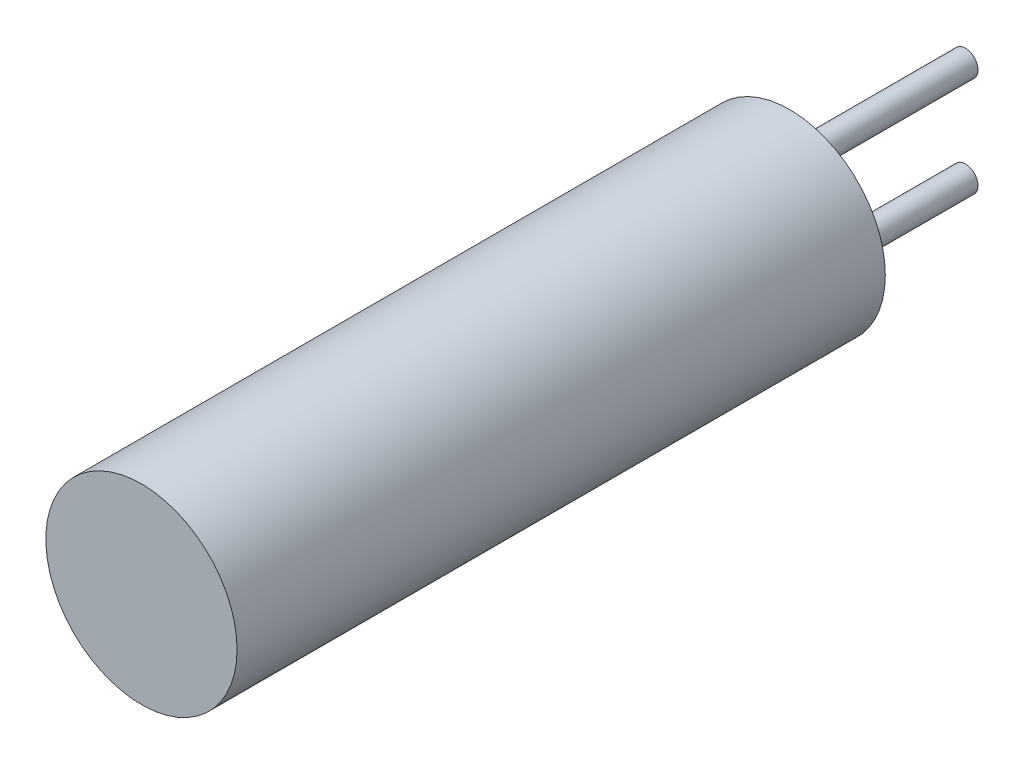
ISO-10303-21;
HEADER;
FILE_DESCRIPTION(('STEP AP214'),'2;1');
FILE_NAME('part.step','',(''),(''),'','','');
FILE_SCHEMA(('AUTOMOTIVE_DESIGN { 1 0 10303 214 1 1 1 1 }'));
ENDSEC;
DATA;
#1=APPLICATION_CONTEXT('core data for automotive mechanical design processes');
#2=APPLICATION_PROTOCOL_DEFINITION('international standard','automotive_design',2000,#1);
#3=PRODUCT_CONTEXT('',#1,'mechanical');
#4=PRODUCT('Part','Part','',(#3));
#5=PRODUCT_RELATED_PRODUCT_CATEGORY('part','',(#4));
#6=PRODUCT_DEFINITION_FORMATION('','',#4);
#7=PRODUCT_DEFINITION_CONTEXT('part definition',#1,'design');
#8=PRODUCT_DEFINITION('design','',#6,#7);
#9=PRODUCT_DEFINITION_SHAPE('','',#8);
#10=(LENGTH_UNIT() NAMED_UNIT(*) SI_UNIT(.MILLI.,.METRE.));
#11=(NAMED_UNIT(*) PLANE_ANGLE_UNIT() SI_UNIT($,.RADIAN.));
#12=(NAMED_UNIT(*) SI_UNIT($,.STERADIAN.) SOLID_ANGLE_UNIT());
#13=UNCERTAINTY_MEASURE_WITH_UNIT(LENGTH_MEASURE(1.E-05),#10,'distance_accuracy_value','');
#14=(GEOMETRIC_REPRESENTATION_CONTEXT(3) GLOBAL_UNCERTAINTY_ASSIGNED_CONTEXT((#13)) GLOBAL_UNIT_ASSIGNED_CONTEXT((#10,
#11,#12)) REPRESENTATION_CONTEXT('',''));
#15=CARTESIAN_POINT('',(0.,0.,0.));
#16=DIRECTION('',(0.,0.,1.));
#17=DIRECTION('',(1.,0.,0.));
#18=AXIS2_PLACEMENT_3D('',#15,#16,#17);
#19=CARTESIAN_POINT('',(0.,0.,-5.42));
#20=DIRECTION('',(0.,0.,-1.));
#21=DIRECTION('',(-1.,0.,0.));
#22=AXIS2_PLACEMENT_3D('',#19,#20,#21);
#23=PLANE('',#22);
#24=CARTESIAN_POINT('',(0.,1.489822979376,-5.42));
#25=DIRECTION('',(0.,0.,-1.));
#26=DIRECTION('',(-1.,0.,0.));
#27=AXIS2_PLACEMENT_3D('',#24,#25,#26);
#28=CIRCLE('',#27,0.3898185985847);
#29=CARTESIAN_POINT('',(-0.3898185985847,1.489822979376,-5.42));
#30=VERTEX_POINT('',#29);
#31=EDGE_CURVE('E18',#30,#30,#28,.F.);
#32=ORIENTED_EDGE('',*,*,#31,.F.);
#33=EDGE_LOOP('',(#32));
#34=FACE_BOUND('',#33,.T.);
#35=ADVANCED_FACE('F15',(#34),#23,.T.);
#36=CARTESIAN_POINT('',(0.,0.,-5.42));
#37=DIRECTION('',(0.,0.,-1.));
#38=DIRECTION('',(-1.,0.,0.));
#39=AXIS2_PLACEMENT_3D('',#36,#37,#38);
#40=PLANE('',#39);
#41=CARTESIAN_POINT('',(0.,-1.602262449517,-5.42));
#42=DIRECTION('',(0.,0.,-1.));
#43=DIRECTION('',(-1.,0.,0.));
#44=AXIS2_PLACEMENT_3D('',#41,#42,#43);
#45=CIRCLE('',#44,0.3898185985847);
#46=CARTESIAN_POINT('',(-0.3898185985847,-1.602262449517,-5.42));
#47=VERTEX_POINT('',#46);
#48=EDGE_CURVE('E34',#47,#47,#45,.F.);
#49=ORIENTED_EDGE('',*,*,#48,.F.);
#50=EDGE_LOOP('',(#49));
#51=FACE_BOUND('',#50,.T.);
#52=ADVANCED_FACE('F45',(#51),#40,.T.);
#53=CARTESIAN_POINT('',(0.,1.489822979376,0.));
#54=DIRECTION('',(0.,0.,-1.));
#55=DIRECTION('',(-1.,0.,0.));
#56=AXIS2_PLACEMENT_3D('',#53,#54,#55);
#57=CYLINDRICAL_SURFACE('',#56,0.3898185985847);
#58=ORIENTED_EDGE('',*,*,#31,.T.);
#59=EDGE_LOOP('',(#58));
#60=FACE_BOUND('',#59,.T.);
#61=CARTESIAN_POINT('',(0.,1.489822979376,0.));
#62=DIRECTION('',(0.,0.,-1.));
#63=DIRECTION('',(-1.,0.,0.));
#64=AXIS2_PLACEMENT_3D('',#61,#62,#63);
#65=CIRCLE('',#64,0.3898185985847);
#66=CARTESIAN_POINT('',(-0.3898185985847,1.489822979376,0.));
#67=VERTEX_POINT('',#66);
#68=EDGE_CURVE('E32',#67,#67,#65,.T.);
#69=ORIENTED_EDGE('',*,*,#68,.T.);
#70=EDGE_LOOP('',(#69));
#71=FACE_BOUND('',#70,.T.);
#72=ADVANCED_FACE('F41',(#60,#71),#57,.T.);
#73=CARTESIAN_POINT('',(0.,-1.602262449517,0.));
#74=DIRECTION('',(0.,0.,-1.));
#75=DIRECTION('',(-1.,0.,0.));
#76=AXIS2_PLACEMENT_3D('',#73,#74,#75);
#77=CYLINDRICAL_SURFACE('',#76,0.3898185985847);
#78=ORIENTED_EDGE('',*,*,#48,.T.);
#79=EDGE_LOOP('',(#78));
#80=FACE_BOUND('',#79,.T.);
#81=CARTESIAN_POINT('',(0.,-1.602262449517,0.));
#82=DIRECTION('',(0.,0.,-1.));
#83=DIRECTION('',(-1.,0.,0.));
#84=AXIS2_PLACEMENT_3D('',#81,#82,#83);
#85=CIRCLE('',#84,0.3898185985847);
#86=CARTESIAN_POINT('',(-0.3898185985847,-1.602262449517,0.));
#87=VERTEX_POINT('',#86);
#88=EDGE_CURVE('E27',#87,#87,#85,.T.);
#89=ORIENTED_EDGE('',*,*,#88,.T.);
#90=EDGE_LOOP('',(#89));
#91=FACE_BOUND('',#90,.T.);
#92=ADVANCED_FACE('F64',(#80,#91),#77,.T.);
#93=CARTESIAN_POINT('',(0.,0.,20.));
#94=DIRECTION('',(0.,0.,1.));
#95=DIRECTION('',(1.,0.,0.));
#96=AXIS2_PLACEMENT_3D('',#93,#94,#95);
#97=PLANE('',#96);
#98=CARTESIAN_POINT('',(0.,0.,20.));
#99=DIRECTION('',(0.,0.,1.));
#100=DIRECTION('',(1.,0.,0.));
#101=AXIS2_PLACEMENT_3D('',#98,#99,#100);
#102=CIRCLE('',#101,2.95);
#103=CARTESIAN_POINT('',(2.95,0.,20.));
#104=VERTEX_POINT('',#103);
#105=EDGE_CURVE('E22',#104,#104,#102,.F.);
#106=ORIENTED_EDGE('',*,*,#105,.F.);
#107=EDGE_LOOP('',(#106));
#108=FACE_BOUND('',#107,.T.);
#109=ADVANCED_FACE('F58',(#108),#97,.T.);
#110=CARTESIAN_POINT('',(0.,0.,0.));
#111=DIRECTION('',(0.,0.,1.));
#112=DIRECTION('',(1.,0.,0.));
#113=AXIS2_PLACEMENT_3D('',#110,#111,#112);
#114=PLANE('',#113);
#115=ORIENTED_EDGE('',*,*,#88,.F.);
#116=EDGE_LOOP('',(#115));
#117=FACE_BOUND('',#116,.T.);
#118=ORIENTED_EDGE('',*,*,#68,.F.);
#119=EDGE_LOOP('',(#118));
#120=FACE_BOUND('',#119,.T.);
#121=CARTESIAN_POINT('',(0.,0.,0.));
#122=DIRECTION('',(0.,0.,1.));
#123=DIRECTION('',(1.,0.,0.));
#124=AXIS2_PLACEMENT_3D('',#121,#122,#123);
#125=CIRCLE('',#124,2.95);
#126=CARTESIAN_POINT('',(2.95,0.,0.));
#127=VERTEX_POINT('',#126);
#128=EDGE_CURVE('E9',#127,#127,#125,.T.);
#129=ORIENTED_EDGE('',*,*,#128,.F.);
#130=EDGE_LOOP('',(#129));
#131=FACE_BOUND('',#130,.T.);
#132=ADVANCED_FACE('F52',(#117,#120,#131),#114,.F.);
#133=CARTESIAN_POINT('',(0.,0.,0.));
#134=DIRECTION('',(0.,0.,1.));
#135=DIRECTION('',(1.,0.,0.));
#136=AXIS2_PLACEMENT_3D('',#133,#134,#135);
#137=CYLINDRICAL_SURFACE('',#136,2.95);
#138=ORIENTED_EDGE('',*,*,#105,.T.);
#139=EDGE_LOOP('',(#138));
#140=FACE_BOUND('',#139,.T.);
#141=ORIENTED_EDGE('',*,*,#128,.T.);
#142=EDGE_LOOP('',(#141));
#143=FACE_BOUND('',#142,.T.);
#144=ADVANCED_FACE('F50',(#140,#143),#137,.T.);
#145=CLOSED_SHELL('',(#35,#52,#72,#92,#109,#132,#144));
#146=MANIFOLD_SOLID_BREP('B1',#145);
#147=ADVANCED_BREP_SHAPE_REPRESENTATION('',(#18,#146),#14);
#148=SHAPE_DEFINITION_REPRESENTATION(#9,#147);
ENDSEC;
END-ISO-10303-21;
